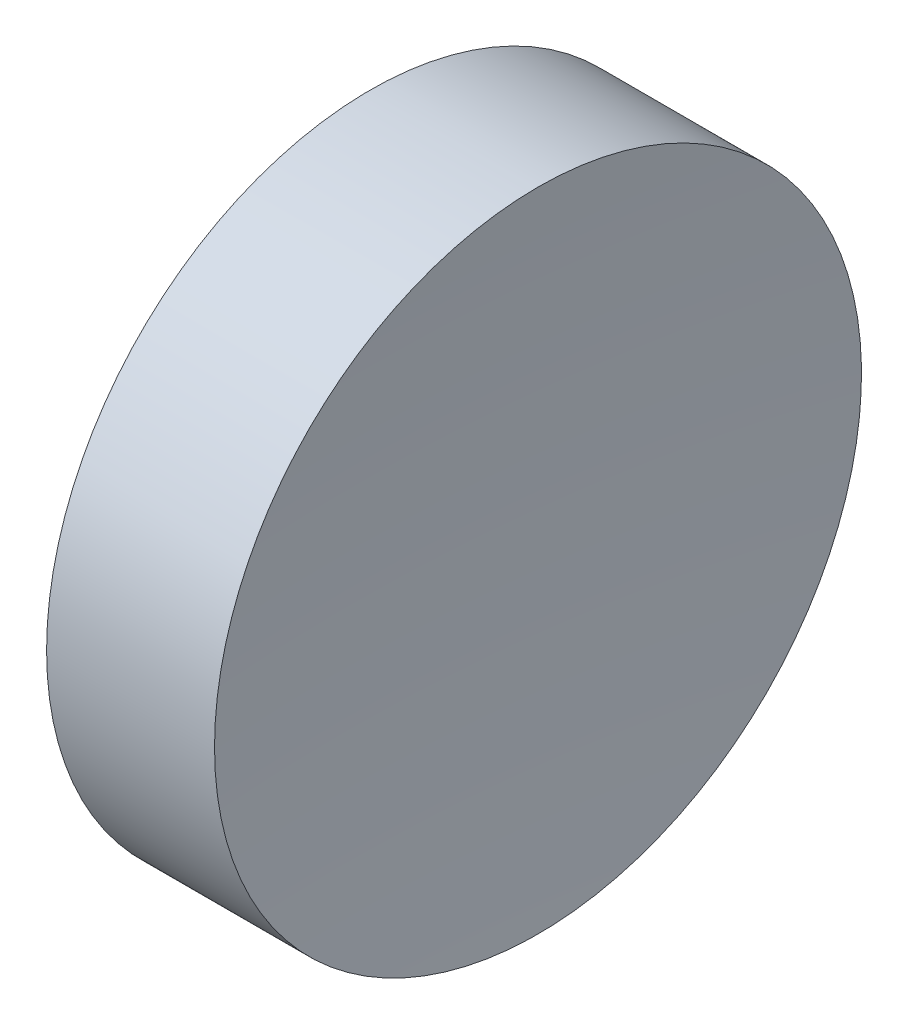
ISO-10303-21;
HEADER;
FILE_DESCRIPTION(('STEP AP214'),'2;1');
FILE_NAME('part.step','',(''),(''),'','','');
FILE_SCHEMA(('AUTOMOTIVE_DESIGN { 1 0 10303 214 1 1 1 1 }'));
ENDSEC;
DATA;
#1=APPLICATION_CONTEXT('core data for automotive mechanical design processes');
#2=APPLICATION_PROTOCOL_DEFINITION('international standard','automotive_design',2000,#1);
#3=PRODUCT_CONTEXT('',#1,'mechanical');
#4=PRODUCT('Part','Part','',(#3));
#5=PRODUCT_RELATED_PRODUCT_CATEGORY('part','',(#4));
#6=PRODUCT_DEFINITION_FORMATION('','',#4);
#7=PRODUCT_DEFINITION_CONTEXT('part definition',#1,'design');
#8=PRODUCT_DEFINITION('design','',#6,#7);
#9=PRODUCT_DEFINITION_SHAPE('','',#8);
#10=(LENGTH_UNIT() NAMED_UNIT(*) SI_UNIT(.MILLI.,.METRE.));
#11=(NAMED_UNIT(*) PLANE_ANGLE_UNIT() SI_UNIT($,.RADIAN.));
#12=(NAMED_UNIT(*) SI_UNIT($,.STERADIAN.) SOLID_ANGLE_UNIT());
#13=UNCERTAINTY_MEASURE_WITH_UNIT(LENGTH_MEASURE(1.E-05),#10,'distance_accuracy_value','');
#14=(GEOMETRIC_REPRESENTATION_CONTEXT(3) GLOBAL_UNCERTAINTY_ASSIGNED_CONTEXT((#13)) GLOBAL_UNIT_ASSIGNED_CONTEXT((#10,
#11,#12)) REPRESENTATION_CONTEXT('',''));
#15=CARTESIAN_POINT('',(0.,0.,0.));
#16=DIRECTION('',(0.,0.,1.));
#17=DIRECTION('',(1.,0.,0.));
#18=AXIS2_PLACEMENT_3D('',#15,#16,#17);
#19=CARTESIAN_POINT('',(140.546327907897,34.6890105616862,0.));
#20=DIRECTION('',(-1.,0.,0.));
#21=DIRECTION('',(0.,1.,0.));
#22=AXIS2_PLACEMENT_3D('',#19,#20,#21);
#23=SPHERICAL_SURFACE('',#22,80.);
#24=CARTESIAN_POINT('',(60.7908422031511,34.6890105616862,0.));
#25=DIRECTION('',(-1.,0.,0.));
#26=DIRECTION('',(0.,0.,1.));
#27=AXIS2_PLACEMENT_3D('',#24,#25,#26);
#28=CIRCLE('',#27,6.25);
#29=CARTESIAN_POINT('',(60.7908422031511,34.6890105616862,6.25));
#30=VERTEX_POINT('',#29);
#31=EDGE_CURVE('E10',#30,#30,#28,.T.);
#32=ORIENTED_EDGE('',*,*,#31,.F.);
#33=EDGE_LOOP('',(#32));
#34=FACE_BOUND('',#33,.T.);
#35=ADVANCED_FACE('F35',(#34),#23,.F.);
#36=CARTESIAN_POINT('',(54.4925715010826,34.6890105616862,0.));
#37=DIRECTION('',(-1.,0.,0.));
#38=DIRECTION('',(0.,0.,1.));
#39=AXIS2_PLACEMENT_3D('',#36,#37,#38);
#40=CYLINDRICAL_SURFACE('',#39,6.25);
#41=CARTESIAN_POINT('',(57.5463277674598,34.6890105616862,0.));
#42=DIRECTION('',(-1.,0.,0.));
#43=DIRECTION('',(0.,0.,1.));
#44=AXIS2_PLACEMENT_3D('',#41,#42,#43);
#45=CIRCLE('',#44,6.25);
#46=CARTESIAN_POINT('',(57.5463277674598,34.6890105616862,6.25));
#47=VERTEX_POINT('',#46);
#48=EDGE_CURVE('E41',#47,#47,#45,.T.);
#49=ORIENTED_EDGE('',*,*,#48,.F.);
#50=EDGE_LOOP('',(#49));
#51=FACE_BOUND('',#50,.T.);
#52=ORIENTED_EDGE('',*,*,#31,.T.);
#53=EDGE_LOOP('',(#52));
#54=FACE_BOUND('',#53,.T.);
#55=ADVANCED_FACE('F49',(#51,#54),#40,.T.);
#56=CARTESIAN_POINT('',(57.5463277674598,34.6890105616862,0.));
#57=DIRECTION('',(1.,0.,0.));
#58=DIRECTION('',(0.,0.,-1.));
#59=AXIS2_PLACEMENT_3D('',#56,#57,#58);
#60=PLANE('',#59);
#61=ORIENTED_EDGE('',*,*,#48,.T.);
#62=EDGE_LOOP('',(#61));
#63=FACE_BOUND('',#62,.T.);
#64=ADVANCED_FACE('F47',(#63),#60,.F.);
#65=CLOSED_SHELL('',(#35,#55,#64));
#66=MANIFOLD_SOLID_BREP('B2',#65);
#67=ADVANCED_BREP_SHAPE_REPRESENTATION('',(#18,#66),#14);
#68=SHAPE_DEFINITION_REPRESENTATION(#9,#67);
ENDSEC;
END-ISO-10303-21;
